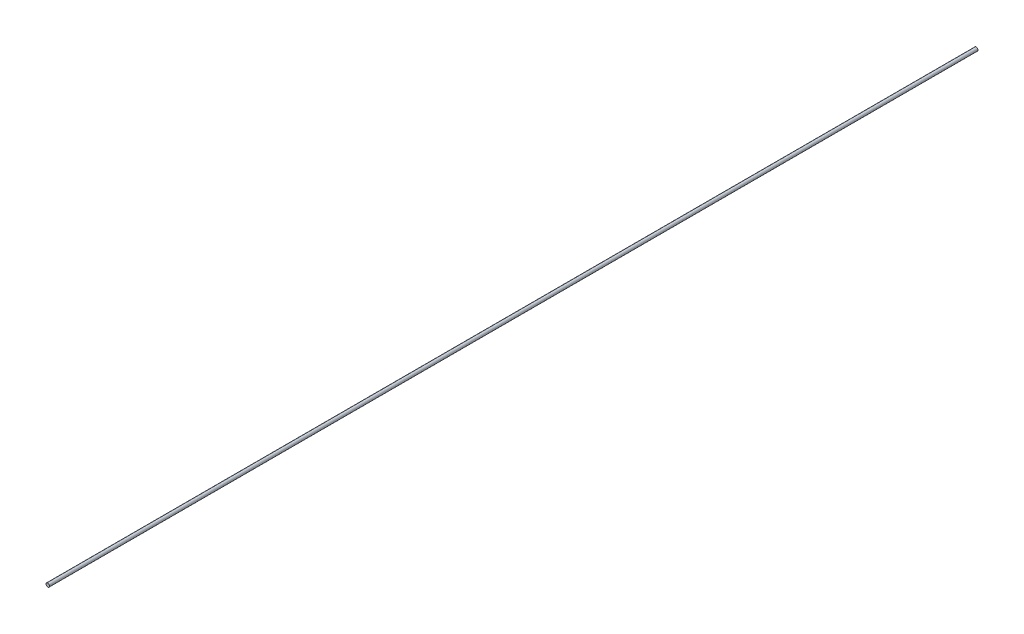
ISO-10303-21;
HEADER;
FILE_DESCRIPTION(('STEP AP214'),'2;1');
FILE_NAME('part.step','',(''),(''),'','','');
FILE_SCHEMA(('AUTOMOTIVE_DESIGN { 1 0 10303 214 1 1 1 1 }'));
ENDSEC;
DATA;
#1=APPLICATION_CONTEXT('core data for automotive mechanical design processes');
#2=APPLICATION_PROTOCOL_DEFINITION('international standard','automotive_design',2000,#1);
#3=PRODUCT_CONTEXT('',#1,'mechanical');
#4=PRODUCT('Part','Part','',(#3));
#5=PRODUCT_RELATED_PRODUCT_CATEGORY('part','',(#4));
#6=PRODUCT_DEFINITION_FORMATION('','',#4);
#7=PRODUCT_DEFINITION_CONTEXT('part definition',#1,'design');
#8=PRODUCT_DEFINITION('design','',#6,#7);
#9=PRODUCT_DEFINITION_SHAPE('','',#8);
#10=(LENGTH_UNIT() NAMED_UNIT(*) SI_UNIT(.MILLI.,.METRE.));
#11=(NAMED_UNIT(*) PLANE_ANGLE_UNIT() SI_UNIT($,.RADIAN.));
#12=(NAMED_UNIT(*) SI_UNIT($,.STERADIAN.) SOLID_ANGLE_UNIT());
#13=UNCERTAINTY_MEASURE_WITH_UNIT(LENGTH_MEASURE(1.E-05),#10,'distance_accuracy_value','');
#14=(GEOMETRIC_REPRESENTATION_CONTEXT(3) GLOBAL_UNCERTAINTY_ASSIGNED_CONTEXT((#13)) GLOBAL_UNIT_ASSIGNED_CONTEXT((#10,
#11,#12)) REPRESENTATION_CONTEXT('',''));
#15=CARTESIAN_POINT('',(0.,0.,0.));
#16=DIRECTION('',(0.,0.,1.));
#17=DIRECTION('',(1.,0.,0.));
#18=AXIS2_PLACEMENT_3D('',#15,#16,#17);
#19=CARTESIAN_POINT('',(0.,0.,2000.));
#20=DIRECTION('',(0.,0.,-1.));
#21=DIRECTION('',(-1.,0.,0.));
#22=AXIS2_PLACEMENT_3D('',#19,#20,#21);
#23=CYLINDRICAL_SURFACE('',#22,3.8);
#24=CARTESIAN_POINT('',(0.,0.,2000.));
#25=DIRECTION('',(0.,0.,1.));
#26=DIRECTION('',(1.,0.,0.));
#27=AXIS2_PLACEMENT_3D('',#24,#25,#26);
#28=CIRCLE('',#27,3.8);
#29=CARTESIAN_POINT('',(3.8,0.,2000.));
#30=VERTEX_POINT('',#29);
#31=EDGE_CURVE('E10',#30,#30,#28,.T.);
#32=ORIENTED_EDGE('',*,*,#31,.F.);
#33=EDGE_LOOP('',(#32));
#34=FACE_BOUND('',#33,.T.);
#35=CARTESIAN_POINT('',(0.,0.,0.));
#36=DIRECTION('',(0.,0.,1.));
#37=DIRECTION('',(1.,0.,0.));
#38=AXIS2_PLACEMENT_3D('',#35,#36,#37);
#39=CIRCLE('',#38,3.8);
#40=CARTESIAN_POINT('',(3.8,0.,0.));
#41=VERTEX_POINT('',#40);
#42=EDGE_CURVE('E37',#41,#41,#39,.T.);
#43=ORIENTED_EDGE('',*,*,#42,.T.);
#44=EDGE_LOOP('',(#43));
#45=FACE_BOUND('',#44,.T.);
#46=ADVANCED_FACE('F34',(#34,#45),#23,.T.);
#47=CARTESIAN_POINT('',(0.,0.,2000.));
#48=DIRECTION('',(0.,0.,1.));
#49=DIRECTION('',(1.,0.,0.));
#50=AXIS2_PLACEMENT_3D('',#47,#48,#49);
#51=PLANE('',#50);
#52=ORIENTED_EDGE('',*,*,#31,.T.);
#53=EDGE_LOOP('',(#52));
#54=FACE_BOUND('',#53,.T.);
#55=ADVANCED_FACE('F49',(#54),#51,.T.);
#56=CARTESIAN_POINT('',(0.,0.,0.));
#57=DIRECTION('',(0.,0.,1.));
#58=DIRECTION('',(1.,0.,0.));
#59=AXIS2_PLACEMENT_3D('',#56,#57,#58);
#60=PLANE('',#59);
#61=ORIENTED_EDGE('',*,*,#42,.F.);
#62=EDGE_LOOP('',(#61));
#63=FACE_BOUND('',#62,.T.);
#64=ADVANCED_FACE('F47',(#63),#60,.F.);
#65=CLOSED_SHELL('',(#46,#55,#64));
#66=MANIFOLD_SOLID_BREP('B2',#65);
#67=ADVANCED_BREP_SHAPE_REPRESENTATION('',(#18,#66),#14);
#68=SHAPE_DEFINITION_REPRESENTATION(#9,#67);
ENDSEC;
END-ISO-10303-21;
